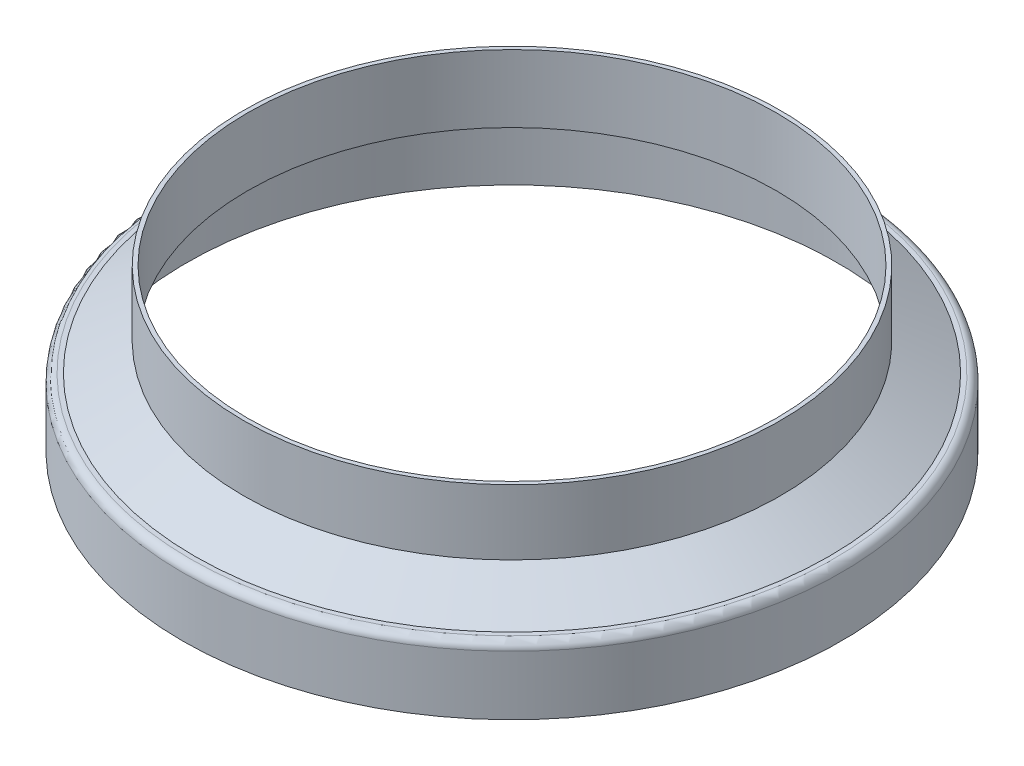
ISO-10303-21;
HEADER;
FILE_DESCRIPTION(('STEP AP214'),'2;1');
FILE_NAME('part.step','',(''),(''),'','','');
FILE_SCHEMA(('AUTOMOTIVE_DESIGN { 1 0 10303 214 1 1 1 1 }'));
ENDSEC;
DATA;
#1=APPLICATION_CONTEXT('core data for automotive mechanical design processes');
#2=APPLICATION_PROTOCOL_DEFINITION('international standard','automotive_design',2000,#1);
#3=PRODUCT_CONTEXT('',#1,'mechanical');
#4=PRODUCT('Part','Part','',(#3));
#5=PRODUCT_RELATED_PRODUCT_CATEGORY('part','',(#4));
#6=PRODUCT_DEFINITION_FORMATION('','',#4);
#7=PRODUCT_DEFINITION_CONTEXT('part definition',#1,'design');
#8=PRODUCT_DEFINITION('design','',#6,#7);
#9=PRODUCT_DEFINITION_SHAPE('','',#8);
#10=(LENGTH_UNIT() NAMED_UNIT(*) SI_UNIT(.MILLI.,.METRE.));
#11=(NAMED_UNIT(*) PLANE_ANGLE_UNIT() SI_UNIT($,.RADIAN.));
#12=(NAMED_UNIT(*) SI_UNIT($,.STERADIAN.) SOLID_ANGLE_UNIT());
#13=UNCERTAINTY_MEASURE_WITH_UNIT(LENGTH_MEASURE(1.E-05),#10,'distance_accuracy_value','');
#14=(GEOMETRIC_REPRESENTATION_CONTEXT(3) GLOBAL_UNCERTAINTY_ASSIGNED_CONTEXT((#13)) GLOBAL_UNIT_ASSIGNED_CONTEXT((#10,
#11,#12)) REPRESENTATION_CONTEXT('',''));
#15=CARTESIAN_POINT('',(0.,0.,0.));
#16=DIRECTION('',(0.,0.,1.));
#17=DIRECTION('',(1.,0.,0.));
#18=AXIS2_PLACEMENT_3D('',#15,#16,#17);
#19=CARTESIAN_POINT('',(21.9075,8.10259999999999,0.));
#20=DIRECTION('',(0.,-1.,0.));
#21=DIRECTION('',(0.,0.,-1.));
#22=AXIS2_PLACEMENT_3D('',#19,#20,#21);
#23=PLANE('',#22);
#24=CARTESIAN_POINT('',(0.,8.10259999999999,0.));
#25=DIRECTION('',(0.,1.,0.));
#26=DIRECTION('',(0.,0.,1.));
#27=AXIS2_PLACEMENT_3D('',#24,#25,#26);
#28=CIRCLE('',#27,21.5265);
#29=CARTESIAN_POINT('',(0.,8.10259999999999,21.5265));
#30=VERTEX_POINT('',#29);
#31=EDGE_CURVE('E10',#30,#30,#28,.T.);
#32=ORIENTED_EDGE('',*,*,#31,.T.);
#33=EDGE_LOOP('',(#32));
#34=FACE_BOUND('',#33,.T.);
#35=CARTESIAN_POINT('',(0.,8.10259999999999,0.));
#36=DIRECTION('',(0.,1.,0.));
#37=DIRECTION('',(0.,0.,1.));
#38=AXIS2_PLACEMENT_3D('',#35,#36,#37);
#39=CIRCLE('',#38,21.9075);
#40=CARTESIAN_POINT('',(0.,8.10259999999999,21.9075));
#41=VERTEX_POINT('',#40);
#42=EDGE_CURVE('E70',#41,#41,#39,.T.);
#43=ORIENTED_EDGE('',*,*,#42,.F.);
#44=EDGE_LOOP('',(#43));
#45=FACE_BOUND('',#44,.T.);
#46=ADVANCED_FACE('F30',(#34,#45),#23,.T.);
#47=CARTESIAN_POINT('',(0.,8.10259999999999,0.));
#48=DIRECTION('',(0.,-1.,0.));
#49=DIRECTION('',(0.,0.,-1.));
#50=AXIS2_PLACEMENT_3D('',#47,#48,#49);
#51=CONICAL_SURFACE('',#50,21.5265,1.04719755119659);
#52=CARTESIAN_POINT('',(0.,10.1336605119822,0.));
#53=DIRECTION('',(0.,1.,0.));
#54=DIRECTION('',(0.,0.,1.));
#55=AXIS2_PLACEMENT_3D('',#52,#53,#54);
#56=CIRCLE('',#55,18.0086);
#57=CARTESIAN_POINT('',(0.,10.1336605119822,18.0086));
#58=VERTEX_POINT('',#57);
#59=EDGE_CURVE('E36',#58,#58,#56,.T.);
#60=ORIENTED_EDGE('',*,*,#59,.T.);
#61=EDGE_LOOP('',(#60));
#62=FACE_BOUND('',#61,.T.);
#63=ORIENTED_EDGE('',*,*,#31,.F.);
#64=EDGE_LOOP('',(#63));
#65=FACE_BOUND('',#64,.T.);
#66=ADVANCED_FACE('F78',(#62,#65),#51,.F.);
#67=CARTESIAN_POINT('',(0.,3.80999999999998,0.));
#68=DIRECTION('',(0.,1.,0.));
#69=DIRECTION('',(0.,0.,1.));
#70=AXIS2_PLACEMENT_3D('',#67,#68,#69);
#71=CYLINDRICAL_SURFACE('',#70,18.0086);
#72=CARTESIAN_POINT('',(0.,14.732,0.));
#73=DIRECTION('',(0.,1.,0.));
#74=DIRECTION('',(0.,0.,1.));
#75=AXIS2_PLACEMENT_3D('',#72,#73,#74);
#76=CIRCLE('',#75,18.0086);
#77=CARTESIAN_POINT('',(0.,14.732,18.0086));
#78=VERTEX_POINT('',#77);
#79=EDGE_CURVE('E40',#78,#78,#76,.T.);
#80=ORIENTED_EDGE('',*,*,#79,.T.);
#81=EDGE_LOOP('',(#80));
#82=FACE_BOUND('',#81,.T.);
#83=ORIENTED_EDGE('',*,*,#59,.F.);
#84=EDGE_LOOP('',(#83));
#85=FACE_BOUND('',#84,.T.);
#86=ADVANCED_FACE('F82',(#82,#85),#71,.F.);
#87=CARTESIAN_POINT('',(18.0086,14.732,0.));
#88=DIRECTION('',(0.,1.,0.));
#89=DIRECTION('',(0.,0.,1.));
#90=AXIS2_PLACEMENT_3D('',#87,#88,#89);
#91=PLANE('',#90);
#92=CARTESIAN_POINT('',(0.,14.732,0.));
#93=DIRECTION('',(0.,1.,0.));
#94=DIRECTION('',(0.,0.,1.));
#95=AXIS2_PLACEMENT_3D('',#92,#93,#94);
#96=CIRCLE('',#95,18.288);
#97=CARTESIAN_POINT('',(0.,14.732,18.288));
#98=VERTEX_POINT('',#97);
#99=EDGE_CURVE('E44',#98,#98,#96,.T.);
#100=ORIENTED_EDGE('',*,*,#99,.T.);
#101=EDGE_LOOP('',(#100));
#102=FACE_BOUND('',#101,.T.);
#103=ORIENTED_EDGE('',*,*,#79,.F.);
#104=EDGE_LOOP('',(#103));
#105=FACE_BOUND('',#104,.T.);
#106=ADVANCED_FACE('F86',(#102,#105),#91,.T.);
#107=CARTESIAN_POINT('',(0.,3.80999999999998,0.));
#108=DIRECTION('',(0.,1.,0.));
#109=DIRECTION('',(0.,0.,1.));
#110=AXIS2_PLACEMENT_3D('',#107,#108,#109);
#111=CYLINDRICAL_SURFACE('',#110,18.288);
#112=CARTESIAN_POINT('',(0.,10.2949721771938,0.));
#113=DIRECTION('',(0.,1.,0.));
#114=DIRECTION('',(0.,0.,1.));
#115=AXIS2_PLACEMENT_3D('',#112,#113,#114);
#116=CIRCLE('',#115,18.288);
#117=CARTESIAN_POINT('',(0.,10.2949721771938,18.288));
#118=VERTEX_POINT('',#117);
#119=EDGE_CURVE('E49',#118,#118,#116,.T.);
#120=ORIENTED_EDGE('',*,*,#119,.T.);
#121=EDGE_LOOP('',(#120));
#122=FACE_BOUND('',#121,.T.);
#123=ORIENTED_EDGE('',*,*,#99,.F.);
#124=EDGE_LOOP('',(#123));
#125=FACE_BOUND('',#124,.T.);
#126=ADVANCED_FACE('F93',(#122,#125),#111,.T.);
#127=CARTESIAN_POINT('',(0.,10.2949721771938,0.));
#128=DIRECTION('',(0.,-1.,0.));
#129=DIRECTION('',(0.,0.,-1.));
#130=AXIS2_PLACEMENT_3D('',#127,#128,#129);
#131=CONICAL_SURFACE('',#130,18.288,1.04719755119659);
#132=CARTESIAN_POINT('',(0.,8.38199999999999,0.));
#133=DIRECTION('',(0.,1.,0.));
#134=DIRECTION('',(0.,0.,1.));
#135=AXIS2_PLACEMENT_3D('',#132,#133,#134);
#136=CIRCLE('',#135,21.6013650043652);
#137=CARTESIAN_POINT('',(0.,8.38199999999999,21.6013650043652));
#138=VERTEX_POINT('',#137);
#139=EDGE_CURVE('E52',#138,#138,#136,.T.);
#140=ORIENTED_EDGE('',*,*,#139,.T.);
#141=EDGE_LOOP('',(#140));
#142=FACE_BOUND('',#141,.T.);
#143=ORIENTED_EDGE('',*,*,#119,.F.);
#144=EDGE_LOOP('',(#143));
#145=FACE_BOUND('',#144,.T.);
#146=ADVANCED_FACE('F97',(#142,#145),#131,.T.);
#147=CARTESIAN_POINT('',(21.6013650043652,8.38199999999999,0.));
#148=DIRECTION('',(0.,1.,0.));
#149=DIRECTION('',(0.,0.,1.));
#150=AXIS2_PLACEMENT_3D('',#147,#148,#149);
#151=PLANE('',#150);
#152=CARTESIAN_POINT('',(0.,8.38199999999999,0.));
#153=DIRECTION('',(0.,1.,0.));
#154=DIRECTION('',(0.,0.,1.));
#155=AXIS2_PLACEMENT_3D('',#152,#153,#154);
#156=CIRCLE('',#155,21.9075);
#157=CARTESIAN_POINT('',(0.,8.38199999999999,21.9075));
#158=VERTEX_POINT('',#157);
#159=EDGE_CURVE('E55',#158,#158,#156,.T.);
#160=ORIENTED_EDGE('',*,*,#159,.T.);
#161=EDGE_LOOP('',(#160));
#162=FACE_BOUND('',#161,.T.);
#163=ORIENTED_EDGE('',*,*,#139,.F.);
#164=EDGE_LOOP('',(#163));
#165=FACE_BOUND('',#164,.T.);
#166=ADVANCED_FACE('F101',(#162,#165),#151,.T.);
#167=CARTESIAN_POINT('',(0.,7.8486,0.));
#168=DIRECTION('',(0.,1.,0.));
#169=DIRECTION('',(0.,0.,1.));
#170=AXIS2_PLACEMENT_3D('',#167,#168,#169);
#171=TOROIDAL_SURFACE('',#170,21.9075,0.533399999999998);
#172=CARTESIAN_POINT('',(0.,7.8486,0.));
#173=DIRECTION('',(0.,1.,0.));
#174=DIRECTION('',(0.,0.,1.));
#175=AXIS2_PLACEMENT_3D('',#172,#173,#174);
#176=CIRCLE('',#175,22.4409);
#177=CARTESIAN_POINT('',(0.,7.8486,22.4409));
#178=VERTEX_POINT('',#177);
#179=EDGE_CURVE('E58',#178,#178,#176,.T.);
#180=ORIENTED_EDGE('',*,*,#179,.T.);
#181=EDGE_LOOP('',(#180));
#182=FACE_BOUND('',#181,.T.);
#183=ORIENTED_EDGE('',*,*,#159,.F.);
#184=EDGE_LOOP('',(#183));
#185=FACE_BOUND('',#184,.T.);
#186=ADVANCED_FACE('F105',(#182,#185),#171,.T.);
#187=CARTESIAN_POINT('',(0.,3.80999999999998,0.));
#188=DIRECTION('',(0.,1.,0.));
#189=DIRECTION('',(0.,0.,1.));
#190=AXIS2_PLACEMENT_3D('',#187,#188,#189);
#191=CYLINDRICAL_SURFACE('',#190,22.4409);
#192=CARTESIAN_POINT('',(0.,3.80999999999998,0.));
#193=DIRECTION('',(0.,1.,0.));
#194=DIRECTION('',(0.,0.,1.));
#195=AXIS2_PLACEMENT_3D('',#192,#193,#194);
#196=CIRCLE('',#195,22.4409);
#197=CARTESIAN_POINT('',(0.,3.80999999999998,22.4409));
#198=VERTEX_POINT('',#197);
#199=EDGE_CURVE('E61',#198,#198,#196,.T.);
#200=ORIENTED_EDGE('',*,*,#199,.T.);
#201=EDGE_LOOP('',(#200));
#202=FACE_BOUND('',#201,.T.);
#203=ORIENTED_EDGE('',*,*,#179,.F.);
#204=EDGE_LOOP('',(#203));
#205=FACE_BOUND('',#204,.T.);
#206=ADVANCED_FACE('F109',(#202,#205),#191,.T.);
#207=CARTESIAN_POINT('',(22.4409,3.80999999999998,0.));
#208=DIRECTION('',(0.,-1.,0.));
#209=DIRECTION('',(0.,0.,-1.));
#210=AXIS2_PLACEMENT_3D('',#207,#208,#209);
#211=PLANE('',#210);
#212=CARTESIAN_POINT('',(0.,3.80999999999998,0.));
#213=DIRECTION('',(0.,1.,0.));
#214=DIRECTION('',(0.,0.,1.));
#215=AXIS2_PLACEMENT_3D('',#212,#213,#214);
#216=CIRCLE('',#215,22.1615);
#217=CARTESIAN_POINT('',(0.,3.80999999999998,22.1615));
#218=VERTEX_POINT('',#217);
#219=EDGE_CURVE('E64',#218,#218,#216,.T.);
#220=ORIENTED_EDGE('',*,*,#219,.T.);
#221=EDGE_LOOP('',(#220));
#222=FACE_BOUND('',#221,.T.);
#223=ORIENTED_EDGE('',*,*,#199,.F.);
#224=EDGE_LOOP('',(#223));
#225=FACE_BOUND('',#224,.T.);
#226=ADVANCED_FACE('F113',(#222,#225),#211,.T.);
#227=CARTESIAN_POINT('',(0.,3.80999999999998,0.));
#228=DIRECTION('',(0.,1.,0.));
#229=DIRECTION('',(0.,0.,1.));
#230=AXIS2_PLACEMENT_3D('',#227,#228,#229);
#231=CYLINDRICAL_SURFACE('',#230,22.1615);
#232=CARTESIAN_POINT('',(0.,7.84859999999998,0.));
#233=DIRECTION('',(0.,1.,0.));
#234=DIRECTION('',(0.,0.,1.));
#235=AXIS2_PLACEMENT_3D('',#232,#233,#234);
#236=CIRCLE('',#235,22.1615);
#237=CARTESIAN_POINT('',(0.,7.84859999999998,22.1615));
#238=VERTEX_POINT('',#237);
#239=EDGE_CURVE('E67',#238,#238,#236,.T.);
#240=ORIENTED_EDGE('',*,*,#239,.T.);
#241=EDGE_LOOP('',(#240));
#242=FACE_BOUND('',#241,.T.);
#243=ORIENTED_EDGE('',*,*,#219,.F.);
#244=EDGE_LOOP('',(#243));
#245=FACE_BOUND('',#244,.T.);
#246=ADVANCED_FACE('F117',(#242,#245),#231,.F.);
#247=CARTESIAN_POINT('',(0.,7.8486,0.));
#248=DIRECTION('',(0.,1.,0.));
#249=DIRECTION('',(0.,0.,1.));
#250=AXIS2_PLACEMENT_3D('',#247,#248,#249);
#251=TOROIDAL_SURFACE('',#250,21.9075,0.253999999999994);
#252=ORIENTED_EDGE('',*,*,#42,.T.);
#253=EDGE_LOOP('',(#252));
#254=FACE_BOUND('',#253,.T.);
#255=ORIENTED_EDGE('',*,*,#239,.F.);
#256=EDGE_LOOP('',(#255));
#257=FACE_BOUND('',#256,.T.);
#258=ADVANCED_FACE('F74',(#254,#257),#251,.F.);
#259=CLOSED_SHELL('',(#46,#66,#86,#106,#126,#146,#166,#186,#206,#226,#246,#258));
#260=MANIFOLD_SOLID_BREP('B2',#259);
#261=ADVANCED_BREP_SHAPE_REPRESENTATION('',(#18,#260),#14);
#262=SHAPE_DEFINITION_REPRESENTATION(#9,#261);
ENDSEC;
END-ISO-10303-21;
